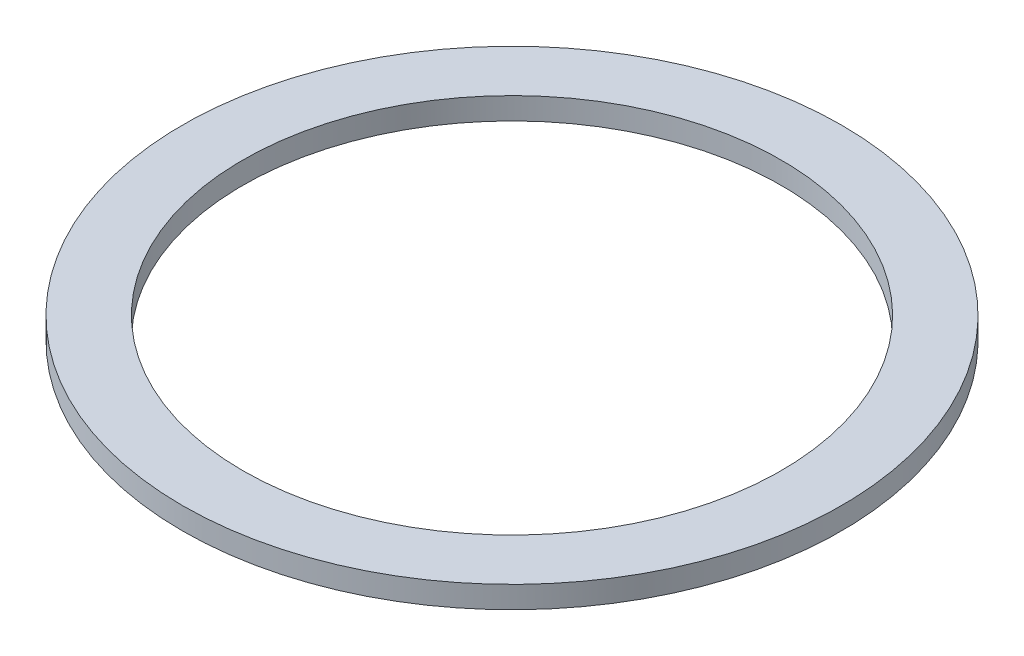
ISO-10303-21;
HEADER;
FILE_DESCRIPTION(('STEP AP214'),'2;1');
FILE_NAME('part.step','',(''),(''),'','','');
FILE_SCHEMA(('AUTOMOTIVE_DESIGN { 1 0 10303 214 1 1 1 1 }'));
ENDSEC;
DATA;
#1=APPLICATION_CONTEXT('core data for automotive mechanical design processes');
#2=APPLICATION_PROTOCOL_DEFINITION('international standard','automotive_design',2000,#1);
#3=PRODUCT_CONTEXT('',#1,'mechanical');
#4=PRODUCT('Part','Part','',(#3));
#5=PRODUCT_RELATED_PRODUCT_CATEGORY('part','',(#4));
#6=PRODUCT_DEFINITION_FORMATION('','',#4);
#7=PRODUCT_DEFINITION_CONTEXT('part definition',#1,'design');
#8=PRODUCT_DEFINITION('design','',#6,#7);
#9=PRODUCT_DEFINITION_SHAPE('','',#8);
#10=(LENGTH_UNIT() NAMED_UNIT(*) SI_UNIT(.MILLI.,.METRE.));
#11=(NAMED_UNIT(*) PLANE_ANGLE_UNIT() SI_UNIT($,.RADIAN.));
#12=(NAMED_UNIT(*) SI_UNIT($,.STERADIAN.) SOLID_ANGLE_UNIT());
#13=UNCERTAINTY_MEASURE_WITH_UNIT(LENGTH_MEASURE(1.E-05),#10,'distance_accuracy_value','');
#14=(GEOMETRIC_REPRESENTATION_CONTEXT(3) GLOBAL_UNCERTAINTY_ASSIGNED_CONTEXT((#13)) GLOBAL_UNIT_ASSIGNED_CONTEXT((#10,
#11,#12)) REPRESENTATION_CONTEXT('',''));
#15=CARTESIAN_POINT('',(0.,0.,0.));
#16=DIRECTION('',(0.,0.,1.));
#17=DIRECTION('',(1.,0.,0.));
#18=AXIS2_PLACEMENT_3D('',#15,#16,#17);
#19=CARTESIAN_POINT('',(0.,1.,0.));
#20=DIRECTION('',(0.,1.,0.));
#21=DIRECTION('',(0.,0.,1.));
#22=AXIS2_PLACEMENT_3D('',#19,#20,#21);
#23=PLANE('',#22);
#24=CARTESIAN_POINT('',(0.,1.,0.));
#25=DIRECTION('',(0.,1.,0.));
#26=DIRECTION('',(0.,0.,1.));
#27=AXIS2_PLACEMENT_3D('',#24,#25,#26);
#28=CIRCLE('',#27,15.);
#29=CARTESIAN_POINT('',(0.,1.,15.));
#30=VERTEX_POINT('',#29);
#31=EDGE_CURVE('E10',#30,#30,#28,.T.);
#32=ORIENTED_EDGE('',*,*,#31,.T.);
#33=EDGE_LOOP('',(#32));
#34=FACE_BOUND('',#33,.T.);
#35=CARTESIAN_POINT('',(0.,1.,0.));
#36=DIRECTION('',(0.,1.,0.));
#37=DIRECTION('',(0.,0.,1.));
#38=AXIS2_PLACEMENT_3D('',#35,#36,#37);
#39=CIRCLE('',#38,12.25);
#40=CARTESIAN_POINT('',(0.,1.,12.25));
#41=VERTEX_POINT('',#40);
#42=EDGE_CURVE('E41',#41,#41,#39,.T.);
#43=ORIENTED_EDGE('',*,*,#42,.F.);
#44=EDGE_LOOP('',(#43));
#45=FACE_BOUND('',#44,.T.);
#46=ADVANCED_FACE('F30',(#34,#45),#23,.T.);
#47=CARTESIAN_POINT('',(0.,0.,0.));
#48=DIRECTION('',(0.,1.,0.));
#49=DIRECTION('',(0.,0.,1.));
#50=AXIS2_PLACEMENT_3D('',#47,#48,#49);
#51=PLANE('',#50);
#52=CARTESIAN_POINT('',(0.,0.,0.));
#53=DIRECTION('',(0.,1.,0.));
#54=DIRECTION('',(0.,0.,1.));
#55=AXIS2_PLACEMENT_3D('',#52,#53,#54);
#56=CIRCLE('',#55,15.);
#57=CARTESIAN_POINT('',(0.,0.,15.));
#58=VERTEX_POINT('',#57);
#59=EDGE_CURVE('E34',#58,#58,#56,.T.);
#60=ORIENTED_EDGE('',*,*,#59,.F.);
#61=EDGE_LOOP('',(#60));
#62=FACE_BOUND('',#61,.T.);
#63=CARTESIAN_POINT('',(0.,0.,0.));
#64=DIRECTION('',(0.,1.,0.));
#65=DIRECTION('',(0.,0.,1.));
#66=AXIS2_PLACEMENT_3D('',#63,#64,#65);
#67=CIRCLE('',#66,12.25);
#68=CARTESIAN_POINT('',(0.,0.,12.25));
#69=VERTEX_POINT('',#68);
#70=EDGE_CURVE('E43',#69,#69,#67,.T.);
#71=ORIENTED_EDGE('',*,*,#70,.T.);
#72=EDGE_LOOP('',(#71));
#73=FACE_BOUND('',#72,.T.);
#74=ADVANCED_FACE('F53',(#62,#73),#51,.F.);
#75=CARTESIAN_POINT('',(0.,1.,0.));
#76=DIRECTION('',(0.,-1.,0.));
#77=DIRECTION('',(0.,0.,-1.));
#78=AXIS2_PLACEMENT_3D('',#75,#76,#77);
#79=CYLINDRICAL_SURFACE('',#78,15.);
#80=ORIENTED_EDGE('',*,*,#31,.F.);
#81=EDGE_LOOP('',(#80));
#82=FACE_BOUND('',#81,.T.);
#83=ORIENTED_EDGE('',*,*,#59,.T.);
#84=EDGE_LOOP('',(#83));
#85=FACE_BOUND('',#84,.T.);
#86=ADVANCED_FACE('F32',(#82,#85),#79,.T.);
#87=CARTESIAN_POINT('',(0.,1.,0.));
#88=DIRECTION('',(0.,-1.,0.));
#89=DIRECTION('',(0.,0.,-1.));
#90=AXIS2_PLACEMENT_3D('',#87,#88,#89);
#91=CYLINDRICAL_SURFACE('',#90,12.25);
#92=ORIENTED_EDGE('',*,*,#42,.T.);
#93=EDGE_LOOP('',(#92));
#94=FACE_BOUND('',#93,.T.);
#95=ORIENTED_EDGE('',*,*,#70,.F.);
#96=EDGE_LOOP('',(#95));
#97=FACE_BOUND('',#96,.T.);
#98=ADVANCED_FACE('F49',(#94,#97),#91,.F.);
#99=CLOSED_SHELL('',(#46,#74,#86,#98));
#100=MANIFOLD_SOLID_BREP('B2',#99);
#101=ADVANCED_BREP_SHAPE_REPRESENTATION('',(#18,#100),#14);
#102=SHAPE_DEFINITION_REPRESENTATION(#9,#101);
ENDSEC;
END-ISO-10303-21;
